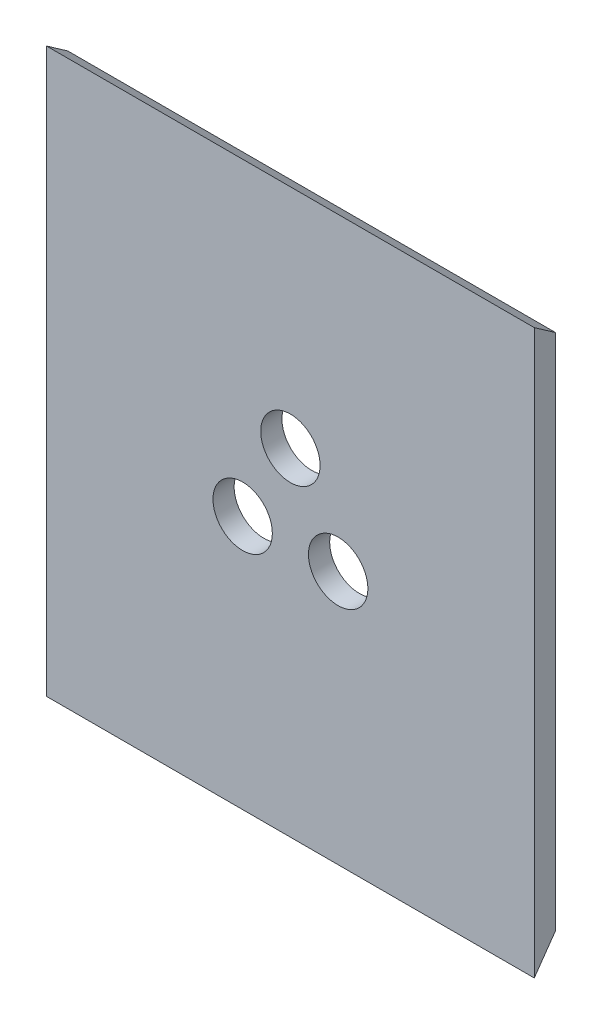
ISO-10303-21;
HEADER;
FILE_DESCRIPTION(('STEP AP214'),'2;1');
FILE_NAME('part.step','',(''),(''),'','','');
FILE_SCHEMA(('AUTOMOTIVE_DESIGN { 1 0 10303 214 1 1 1 1 }'));
ENDSEC;
DATA;
#1=APPLICATION_CONTEXT('core data for automotive mechanical design processes');
#2=APPLICATION_PROTOCOL_DEFINITION('international standard','automotive_design',2000,#1);
#3=PRODUCT_CONTEXT('',#1,'mechanical');
#4=PRODUCT('Part','Part','',(#3));
#5=PRODUCT_RELATED_PRODUCT_CATEGORY('part','',(#4));
#6=PRODUCT_DEFINITION_FORMATION('','',#4);
#7=PRODUCT_DEFINITION_CONTEXT('part definition',#1,'design');
#8=PRODUCT_DEFINITION('design','',#6,#7);
#9=PRODUCT_DEFINITION_SHAPE('','',#8);
#10=(LENGTH_UNIT() NAMED_UNIT(*) SI_UNIT(.MILLI.,.METRE.));
#11=(NAMED_UNIT(*) PLANE_ANGLE_UNIT() SI_UNIT($,.RADIAN.));
#12=(NAMED_UNIT(*) SI_UNIT($,.STERADIAN.) SOLID_ANGLE_UNIT());
#13=UNCERTAINTY_MEASURE_WITH_UNIT(LENGTH_MEASURE(1.E-05),#10,'distance_accuracy_value','');
#14=(GEOMETRIC_REPRESENTATION_CONTEXT(3) GLOBAL_UNCERTAINTY_ASSIGNED_CONTEXT((#13)) GLOBAL_UNIT_ASSIGNED_CONTEXT((#10,
#11,#12)) REPRESENTATION_CONTEXT('',''));
#15=CARTESIAN_POINT('',(0.,0.,0.));
#16=DIRECTION('',(0.,0.,1.));
#17=DIRECTION('',(1.,0.,0.));
#18=AXIS2_PLACEMENT_3D('',#15,#16,#17);
#19=CARTESIAN_POINT('',(0.,0.,5.));
#20=DIRECTION('',(0.,0.,1.));
#21=DIRECTION('',(1.,0.,0.));
#22=AXIS2_PLACEMENT_3D('',#19,#20,#21);
#23=PLANE('',#22);
#24=CARTESIAN_POINT('',(-11.2583302491977,-6.49999999999997,5.));
#25=DIRECTION('',(0.,0.,1.));
#26=DIRECTION('',(1.,0.,0.));
#27=AXIS2_PLACEMENT_3D('',#24,#25,#26);
#28=CIRCLE('',#27,7.);
#29=CARTESIAN_POINT('',(-4.25833024919771,-6.49999999999997,5.));
#30=VERTEX_POINT('',#29);
#31=EDGE_CURVE('E121',#30,#30,#28,.T.);
#32=ORIENTED_EDGE('',*,*,#31,.F.);
#33=EDGE_LOOP('',(#32));
#34=FACE_BOUND('',#33,.T.);
#35=DIRECTION('',(0.,-1.,0.));
#36=VECTOR('',#35,1.);
#37=CARTESIAN_POINT('',(-57.5,66.4,5.));
#38=LINE('',#37,#36);
#39=CARTESIAN_POINT('',(-57.5,66.4,5.));
#40=VERTEX_POINT('',#39);
#41=CARTESIAN_POINT('',(-57.5,-66.4,5.));
#42=VERTEX_POINT('',#41);
#43=EDGE_CURVE('E97',#40,#42,#38,.T.);
#44=ORIENTED_EDGE('',*,*,#43,.T.);
#45=DIRECTION('',(1.,0.,0.));
#46=VECTOR('',#45,1.);
#47=CARTESIAN_POINT('',(-57.5,-66.4,5.));
#48=LINE('',#47,#46);
#49=CARTESIAN_POINT('',(57.5,-66.4,5.));
#50=VERTEX_POINT('',#49);
#51=EDGE_CURVE('E113',#42,#50,#48,.T.);
#52=ORIENTED_EDGE('',*,*,#51,.T.);
#53=DIRECTION('',(0.,1.,0.));
#54=VECTOR('',#53,1.);
#55=CARTESIAN_POINT('',(57.5,66.4,5.));
#56=LINE('',#55,#54);
#57=CARTESIAN_POINT('',(57.5,66.4,5.));
#58=VERTEX_POINT('',#57);
#59=EDGE_CURVE('E49',#50,#58,#56,.T.);
#60=ORIENTED_EDGE('',*,*,#59,.T.);
#61=DIRECTION('',(-1.,0.,0.));
#62=VECTOR('',#61,1.);
#63=CARTESIAN_POINT('',(-57.5,66.4,5.));
#64=LINE('',#63,#62);
#65=EDGE_CURVE('E11',#58,#40,#64,.T.);
#66=ORIENTED_EDGE('',*,*,#65,.T.);
#67=EDGE_LOOP('',(#44,#52,#60,#66));
#68=FACE_BOUND('',#67,.T.);
#69=CARTESIAN_POINT('',(0.,13.,5.));
#70=DIRECTION('',(0.,0.,1.));
#71=DIRECTION('',(1.,0.,0.));
#72=AXIS2_PLACEMENT_3D('',#69,#70,#71);
#73=CIRCLE('',#72,7.);
#74=CARTESIAN_POINT('',(7.,13.,5.));
#75=VERTEX_POINT('',#74);
#76=EDGE_CURVE('E103',#75,#75,#73,.T.);
#77=ORIENTED_EDGE('',*,*,#76,.F.);
#78=EDGE_LOOP('',(#77));
#79=FACE_BOUND('',#78,.T.);
#80=CARTESIAN_POINT('',(11.2583302491977,-6.49999999999997,5.));
#81=DIRECTION('',(0.,0.,1.));
#82=DIRECTION('',(-1.,0.,0.));
#83=AXIS2_PLACEMENT_3D('',#80,#81,#82);
#84=CIRCLE('',#83,7.);
#85=CARTESIAN_POINT('',(4.25833024919771,-6.49999999999997,5.));
#86=VERTEX_POINT('',#85);
#87=EDGE_CURVE('E127',#86,#86,#84,.T.);
#88=ORIENTED_EDGE('',*,*,#87,.F.);
#89=EDGE_LOOP('',(#88));
#90=FACE_BOUND('',#89,.T.);
#91=ADVANCED_FACE('F39',(#34,#68,#79,#90),#23,.T.);
#92=CARTESIAN_POINT('',(0.,0.,0.));
#93=DIRECTION('',(0.,0.,1.));
#94=DIRECTION('',(1.,0.,0.));
#95=AXIS2_PLACEMENT_3D('',#92,#93,#94);
#96=PLANE('',#95);
#97=DIRECTION('',(0.,-1.,0.));
#98=VECTOR('',#97,1.);
#99=CARTESIAN_POINT('',(-57.5,66.4,0.));
#100=LINE('',#99,#98);
#101=CARTESIAN_POINT('',(-57.5,62.8989623089515,0.));
#102=VERTEX_POINT('',#101);
#103=CARTESIAN_POINT('',(-57.5,-59.2592599662895,0.));
#104=VERTEX_POINT('',#103);
#105=EDGE_CURVE('E95',#102,#104,#100,.T.);
#106=ORIENTED_EDGE('',*,*,#105,.F.);
#107=DIRECTION('',(1.,0.,0.));
#108=VECTOR('',#107,1.);
#109=CARTESIAN_POINT('',(-57.501,62.8989623089515,0.));
#110=LINE('',#109,#108);
#111=CARTESIAN_POINT('',(57.5,62.8989623089515,0.));
#112=VERTEX_POINT('',#111);
#113=EDGE_CURVE('E81',#102,#112,#110,.T.);
#114=ORIENTED_EDGE('',*,*,#113,.T.);
#115=DIRECTION('',(0.,1.,0.));
#116=VECTOR('',#115,1.);
#117=CARTESIAN_POINT('',(57.5,66.4,0.));
#118=LINE('',#117,#116);
#119=CARTESIAN_POINT('',(57.5,-59.2592599662894,0.));
#120=VERTEX_POINT('',#119);
#121=EDGE_CURVE('E43',#120,#112,#118,.T.);
#122=ORIENTED_EDGE('',*,*,#121,.F.);
#123=DIRECTION('',(1.,0.,0.));
#124=VECTOR('',#123,1.);
#125=CARTESIAN_POINT('',(-57.501,-59.2592599662895,0.));
#126=LINE('',#125,#124);
#127=EDGE_CURVE('E57',#104,#120,#126,.T.);
#128=ORIENTED_EDGE('',*,*,#127,.F.);
#129=EDGE_LOOP('',(#106,#114,#122,#128));
#130=FACE_BOUND('',#129,.T.);
#131=CARTESIAN_POINT('',(0.,13.,0.));
#132=DIRECTION('',(0.,0.,1.));
#133=DIRECTION('',(1.,0.,0.));
#134=AXIS2_PLACEMENT_3D('',#131,#132,#133);
#135=CIRCLE('',#134,7.);
#136=CARTESIAN_POINT('',(7.,13.,0.));
#137=VERTEX_POINT('',#136);
#138=EDGE_CURVE('E107',#137,#137,#135,.T.);
#139=ORIENTED_EDGE('',*,*,#138,.T.);
#140=EDGE_LOOP('',(#139));
#141=FACE_BOUND('',#140,.T.);
#142=CARTESIAN_POINT('',(-11.2583302491977,-6.49999999999997,0.));
#143=DIRECTION('',(0.,0.,1.));
#144=DIRECTION('',(1.,0.,0.));
#145=AXIS2_PLACEMENT_3D('',#142,#143,#144);
#146=CIRCLE('',#145,7.);
#147=CARTESIAN_POINT('',(-4.25833024919771,-6.49999999999997,0.));
#148=VERTEX_POINT('',#147);
#149=EDGE_CURVE('E123',#148,#148,#146,.T.);
#150=ORIENTED_EDGE('',*,*,#149,.T.);
#151=EDGE_LOOP('',(#150));
#152=FACE_BOUND('',#151,.T.);
#153=CARTESIAN_POINT('',(11.2583302491977,-6.49999999999997,0.));
#154=DIRECTION('',(0.,0.,1.));
#155=DIRECTION('',(-1.,0.,0.));
#156=AXIS2_PLACEMENT_3D('',#153,#154,#155);
#157=CIRCLE('',#156,7.);
#158=CARTESIAN_POINT('',(4.25833024919771,-6.49999999999997,0.));
#159=VERTEX_POINT('',#158);
#160=EDGE_CURVE('E131',#159,#159,#157,.T.);
#161=ORIENTED_EDGE('',*,*,#160,.T.);
#162=EDGE_LOOP('',(#161));
#163=FACE_BOUND('',#162,.T.);
#164=ADVANCED_FACE('F100',(#130,#141,#152,#163),#96,.F.);
#165=CARTESIAN_POINT('',(-57.5,66.4,5.));
#166=DIRECTION('',(1.,0.,0.));
#167=DIRECTION('',(0.,0.,-1.));
#168=AXIS2_PLACEMENT_3D('',#165,#166,#167);
#169=PLANE('',#168);
#170=ORIENTED_EDGE('',*,*,#43,.F.);
#171=DIRECTION('',(0.,0.573576436351042,0.819152044288995));
#172=VECTOR('',#171,1.);
#173=CARTESIAN_POINT('',(-57.5,62.8989623089515,0.));
#174=LINE('',#173,#172);
#175=EDGE_CURVE('E65',#102,#40,#174,.T.);
#176=ORIENTED_EDGE('',*,*,#175,.F.);
#177=ORIENTED_EDGE('',*,*,#105,.T.);
#178=DIRECTION('',(0.,0.819152044288989,-0.57357643635105));
#179=VECTOR('',#178,1.);
#180=CARTESIAN_POINT('',(-57.5,-59.2592599662895,0.));
#181=LINE('',#180,#179);
#182=EDGE_CURVE('E90',#42,#104,#181,.T.);
#183=ORIENTED_EDGE('',*,*,#182,.F.);
#184=EDGE_LOOP('',(#170,#176,#177,#183));
#185=FACE_BOUND('',#184,.T.);
#186=ADVANCED_FACE('F41',(#185),#169,.F.);
#187=CARTESIAN_POINT('',(57.5,66.4,5.));
#188=DIRECTION('',(-1.,0.,0.));
#189=DIRECTION('',(0.,-1.,0.));
#190=AXIS2_PLACEMENT_3D('',#187,#188,#189);
#191=PLANE('',#190);
#192=ORIENTED_EDGE('',*,*,#121,.T.);
#193=DIRECTION('',(0.,-0.573576436351042,-0.819152044288995));
#194=VECTOR('',#193,1.);
#195=CARTESIAN_POINT('',(57.5,62.8989623089515,0.));
#196=LINE('',#195,#194);
#197=EDGE_CURVE('E84',#58,#112,#196,.T.);
#198=ORIENTED_EDGE('',*,*,#197,.F.);
#199=ORIENTED_EDGE('',*,*,#59,.F.);
#200=DIRECTION('',(0.,-0.819152044288989,0.57357643635105));
#201=VECTOR('',#200,1.);
#202=CARTESIAN_POINT('',(57.5,-59.2592599662895,0.));
#203=LINE('',#202,#201);
#204=EDGE_CURVE('E140',#120,#50,#203,.T.);
#205=ORIENTED_EDGE('',*,*,#204,.F.);
#206=EDGE_LOOP('',(#192,#198,#199,#205));
#207=FACE_BOUND('',#206,.T.);
#208=ADVANCED_FACE('F151',(#207),#191,.F.);
#209=CARTESIAN_POINT('',(0.,13.,5.));
#210=DIRECTION('',(0.,0.,-1.));
#211=DIRECTION('',(-1.,0.,0.));
#212=AXIS2_PLACEMENT_3D('',#209,#210,#211);
#213=CYLINDRICAL_SURFACE('',#212,7.);
#214=ORIENTED_EDGE('',*,*,#76,.T.);
#215=EDGE_LOOP('',(#214));
#216=FACE_BOUND('',#215,.T.);
#217=ORIENTED_EDGE('',*,*,#138,.F.);
#218=EDGE_LOOP('',(#217));
#219=FACE_BOUND('',#218,.T.);
#220=ADVANCED_FACE('F153',(#216,#219),#213,.F.);
#221=CARTESIAN_POINT('',(-11.2583302491977,-6.49999999999997,5.));
#222=DIRECTION('',(0.,0.,-1.));
#223=DIRECTION('',(-1.,0.,0.));
#224=AXIS2_PLACEMENT_3D('',#221,#222,#223);
#225=CYLINDRICAL_SURFACE('',#224,7.);
#226=ORIENTED_EDGE('',*,*,#31,.T.);
#227=EDGE_LOOP('',(#226));
#228=FACE_BOUND('',#227,.T.);
#229=ORIENTED_EDGE('',*,*,#149,.F.);
#230=EDGE_LOOP('',(#229));
#231=FACE_BOUND('',#230,.T.);
#232=ADVANCED_FACE('F158',(#228,#231),#225,.F.);
#233=CARTESIAN_POINT('',(11.2583302491977,-6.49999999999997,5.));
#234=DIRECTION('',(0.,0.,-1.));
#235=DIRECTION('',(-1.,0.,0.));
#236=AXIS2_PLACEMENT_3D('',#233,#234,#235);
#237=CYLINDRICAL_SURFACE('',#236,7.);
#238=ORIENTED_EDGE('',*,*,#87,.T.);
#239=EDGE_LOOP('',(#238));
#240=FACE_BOUND('',#239,.T.);
#241=ORIENTED_EDGE('',*,*,#160,.F.);
#242=EDGE_LOOP('',(#241));
#243=FACE_BOUND('',#242,.T.);
#244=ADVANCED_FACE('F172',(#240,#243),#237,.F.);
#245=CARTESIAN_POINT('',(-57.501,-59.2592599662895,0.));
#246=DIRECTION('',(0.,0.57357643635105,0.819152044288989));
#247=DIRECTION('',(0.,-0.819152044288989,0.57357643635105));
#248=AXIS2_PLACEMENT_3D('',#245,#246,#247);
#249=PLANE('',#248);
#250=ORIENTED_EDGE('',*,*,#182,.T.);
#251=ORIENTED_EDGE('',*,*,#127,.T.);
#252=ORIENTED_EDGE('',*,*,#204,.T.);
#253=ORIENTED_EDGE('',*,*,#51,.F.);
#254=EDGE_LOOP('',(#250,#251,#252,#253));
#255=FACE_BOUND('',#254,.T.);
#256=ADVANCED_FACE('F146',(#255),#249,.F.);
#257=CARTESIAN_POINT('',(-57.501,62.8989623089515,0.));
#258=DIRECTION('',(0.,-0.819152044288995,0.573576436351042));
#259=DIRECTION('',(0.,-0.573576436351042,-0.819152044288995));
#260=AXIS2_PLACEMENT_3D('',#257,#258,#259);
#261=PLANE('',#260);
#262=ORIENTED_EDGE('',*,*,#175,.T.);
#263=ORIENTED_EDGE('',*,*,#65,.F.);
#264=ORIENTED_EDGE('',*,*,#197,.T.);
#265=ORIENTED_EDGE('',*,*,#113,.F.);
#266=EDGE_LOOP('',(#262,#263,#264,#265));
#267=FACE_BOUND('',#266,.T.);
#268=ADVANCED_FACE('F82',(#267),#261,.F.);
#269=CLOSED_SHELL('',(#91,#164,#186,#208,#220,#232,#244,#256,#268));
#270=MANIFOLD_SOLID_BREP('B2',#269);
#271=ADVANCED_BREP_SHAPE_REPRESENTATION('',(#18,#270),#14);
#272=SHAPE_DEFINITION_REPRESENTATION(#9,#271);
ENDSEC;
END-ISO-10303-21;
